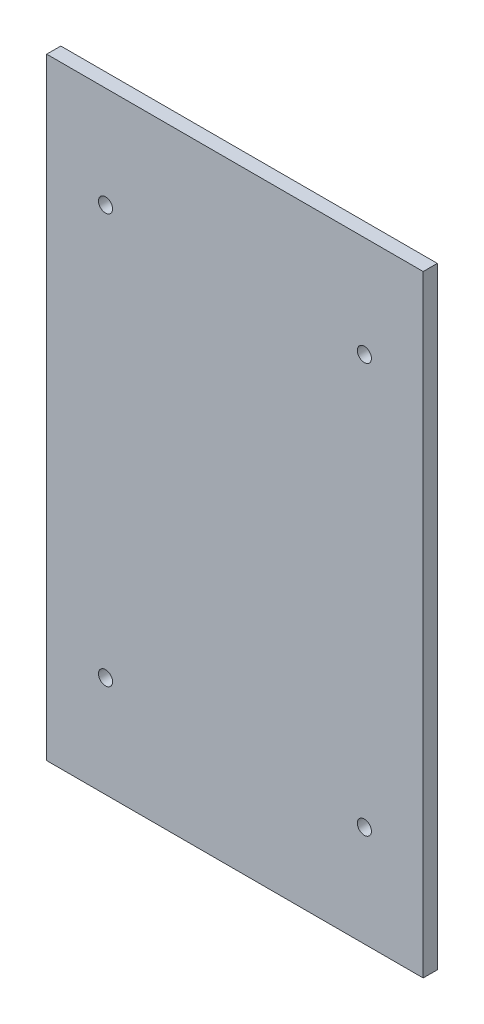
ISO-10303-21;
HEADER;
FILE_DESCRIPTION(('STEP AP214'),'2;1');
FILE_NAME('part.step','',(''),(''),'','','');
FILE_SCHEMA(('AUTOMOTIVE_DESIGN { 1 0 10303 214 1 1 1 1 }'));
ENDSEC;
DATA;
#1=APPLICATION_CONTEXT('core data for automotive mechanical design processes');
#2=APPLICATION_PROTOCOL_DEFINITION('international standard','automotive_design',2000,#1);
#3=PRODUCT_CONTEXT('',#1,'mechanical');
#4=PRODUCT('Part','Part','',(#3));
#5=PRODUCT_RELATED_PRODUCT_CATEGORY('part','',(#4));
#6=PRODUCT_DEFINITION_FORMATION('','',#4);
#7=PRODUCT_DEFINITION_CONTEXT('part definition',#1,'design');
#8=PRODUCT_DEFINITION('design','',#6,#7);
#9=PRODUCT_DEFINITION_SHAPE('','',#8);
#10=(LENGTH_UNIT() NAMED_UNIT(*) SI_UNIT(.MILLI.,.METRE.));
#11=(NAMED_UNIT(*) PLANE_ANGLE_UNIT() SI_UNIT($,.RADIAN.));
#12=(NAMED_UNIT(*) SI_UNIT($,.STERADIAN.) SOLID_ANGLE_UNIT());
#13=UNCERTAINTY_MEASURE_WITH_UNIT(LENGTH_MEASURE(1.E-05),#10,'distance_accuracy_value','');
#14=(GEOMETRIC_REPRESENTATION_CONTEXT(3) GLOBAL_UNCERTAINTY_ASSIGNED_CONTEXT((#13)) GLOBAL_UNIT_ASSIGNED_CONTEXT((#10,
#11,#12)) REPRESENTATION_CONTEXT('',''));
#15=CARTESIAN_POINT('',(0.,0.,0.));
#16=DIRECTION('',(0.,0.,1.));
#17=DIRECTION('',(1.,0.,0.));
#18=AXIS2_PLACEMENT_3D('',#15,#16,#17);
#19=CARTESIAN_POINT('',(-67.5,35.688006393794,3.));
#20=DIRECTION('',(0.,1.,0.));
#21=DIRECTION('',(0.,0.,1.));
#22=AXIS2_PLACEMENT_3D('',#19,#20,#21);
#23=PLANE('',#22);
#24=DIRECTION('',(1.,0.,0.));
#25=VECTOR('',#24,1.);
#26=CARTESIAN_POINT('',(-67.5,35.688006393794,0.));
#27=LINE('',#26,#25);
#28=CARTESIAN_POINT('',(-67.5,35.688006393794,0.));
#29=VERTEX_POINT('',#28);
#30=CARTESIAN_POINT('',(12.5,35.688006393794,0.));
#31=VERTEX_POINT('',#30);
#32=EDGE_CURVE('E110',#29,#31,#27,.T.);
#33=ORIENTED_EDGE('',*,*,#32,.F.);
#34=DIRECTION('',(0.,0.,-1.));
#35=VECTOR('',#34,1.);
#36=CARTESIAN_POINT('',(-67.5,35.688006393794,3.));
#37=LINE('',#36,#35);
#38=CARTESIAN_POINT('',(-67.5,35.688006393794,3.));
#39=VERTEX_POINT('',#38);
#40=EDGE_CURVE('E11',#39,#29,#37,.T.);
#41=ORIENTED_EDGE('',*,*,#40,.F.);
#42=DIRECTION('',(1.,0.,0.));
#43=VECTOR('',#42,1.);
#44=CARTESIAN_POINT('',(-67.5,35.688006393794,3.));
#45=LINE('',#44,#43);
#46=CARTESIAN_POINT('',(12.5,35.688006393794,3.));
#47=VERTEX_POINT('',#46);
#48=EDGE_CURVE('E102',#39,#47,#45,.T.);
#49=ORIENTED_EDGE('',*,*,#48,.T.);
#50=DIRECTION('',(0.,0.,-1.));
#51=VECTOR('',#50,1.);
#52=CARTESIAN_POINT('',(12.5,35.688006393794,3.));
#53=LINE('',#52,#51);
#54=EDGE_CURVE('E41',#47,#31,#53,.T.);
#55=ORIENTED_EDGE('',*,*,#54,.T.);
#56=EDGE_LOOP('',(#33,#41,#49,#55));
#57=FACE_BOUND('',#56,.T.);
#58=ADVANCED_FACE('F38',(#57),#23,.T.);
#59=CARTESIAN_POINT('',(-67.5,35.688006393794,3.));
#60=DIRECTION('',(1.,0.,0.));
#61=DIRECTION('',(0.,0.,-1.));
#62=AXIS2_PLACEMENT_3D('',#59,#60,#61);
#63=PLANE('',#62);
#64=DIRECTION('',(0.,-1.,0.));
#65=VECTOR('',#64,1.);
#66=CARTESIAN_POINT('',(-67.5,35.688006393794,0.));
#67=LINE('',#66,#65);
#68=CARTESIAN_POINT('',(-67.5,-94.311993606206,0.));
#69=VERTEX_POINT('',#68);
#70=EDGE_CURVE('E72',#29,#69,#67,.T.);
#71=ORIENTED_EDGE('',*,*,#70,.T.);
#72=DIRECTION('',(0.,0.,-1.));
#73=VECTOR('',#72,1.);
#74=CARTESIAN_POINT('',(-67.5,-94.311993606206,3.));
#75=LINE('',#74,#73);
#76=CARTESIAN_POINT('',(-67.5,-94.311993606206,3.));
#77=VERTEX_POINT('',#76);
#78=EDGE_CURVE('E48',#77,#69,#75,.T.);
#79=ORIENTED_EDGE('',*,*,#78,.F.);
#80=DIRECTION('',(0.,-1.,0.));
#81=VECTOR('',#80,1.);
#82=CARTESIAN_POINT('',(-67.5,35.688006393794,3.));
#83=LINE('',#82,#81);
#84=EDGE_CURVE('E89',#39,#77,#83,.T.);
#85=ORIENTED_EDGE('',*,*,#84,.F.);
#86=ORIENTED_EDGE('',*,*,#40,.T.);
#87=EDGE_LOOP('',(#71,#79,#85,#86));
#88=FACE_BOUND('',#87,.T.);
#89=ADVANCED_FACE('F127',(#88),#63,.F.);
#90=CARTESIAN_POINT('',(-67.5,-94.311993606206,3.));
#91=DIRECTION('',(0.,1.,0.));
#92=DIRECTION('',(0.,0.,1.));
#93=AXIS2_PLACEMENT_3D('',#90,#91,#92);
#94=PLANE('',#93);
#95=DIRECTION('',(1.,0.,0.));
#96=VECTOR('',#95,1.);
#97=CARTESIAN_POINT('',(-67.5,-94.311993606206,0.));
#98=LINE('',#97,#96);
#99=CARTESIAN_POINT('',(12.5,-94.311993606206,0.));
#100=VERTEX_POINT('',#99);
#101=EDGE_CURVE('E97',#69,#100,#98,.T.);
#102=ORIENTED_EDGE('',*,*,#101,.T.);
#103=DIRECTION('',(0.,0.,-1.));
#104=VECTOR('',#103,1.);
#105=CARTESIAN_POINT('',(12.5,-94.311993606206,3.));
#106=LINE('',#105,#104);
#107=CARTESIAN_POINT('',(12.5,-94.311993606206,3.));
#108=VERTEX_POINT('',#107);
#109=EDGE_CURVE('E94',#108,#100,#106,.T.);
#110=ORIENTED_EDGE('',*,*,#109,.F.);
#111=DIRECTION('',(1.,0.,0.));
#112=VECTOR('',#111,1.);
#113=CARTESIAN_POINT('',(-67.5,-94.311993606206,3.));
#114=LINE('',#113,#112);
#115=EDGE_CURVE('E84',#77,#108,#114,.T.);
#116=ORIENTED_EDGE('',*,*,#115,.F.);
#117=ORIENTED_EDGE('',*,*,#78,.T.);
#118=EDGE_LOOP('',(#102,#110,#116,#117));
#119=FACE_BOUND('',#118,.T.);
#120=ADVANCED_FACE('F95',(#119),#94,.F.);
#121=CARTESIAN_POINT('',(12.5,35.688006393794,3.));
#122=DIRECTION('',(1.,0.,0.));
#123=DIRECTION('',(0.,1.,0.));
#124=AXIS2_PLACEMENT_3D('',#121,#122,#123);
#125=PLANE('',#124);
#126=DIRECTION('',(0.,-1.,0.));
#127=VECTOR('',#126,1.);
#128=CARTESIAN_POINT('',(12.5,35.688006393794,0.));
#129=LINE('',#128,#127);
#130=EDGE_CURVE('E114',#31,#100,#129,.T.);
#131=ORIENTED_EDGE('',*,*,#130,.F.);
#132=ORIENTED_EDGE('',*,*,#54,.F.);
#133=DIRECTION('',(0.,-1.,0.));
#134=VECTOR('',#133,1.);
#135=CARTESIAN_POINT('',(12.5,35.688006393794,3.));
#136=LINE('',#135,#134);
#137=EDGE_CURVE('E88',#47,#108,#136,.T.);
#138=ORIENTED_EDGE('',*,*,#137,.T.);
#139=ORIENTED_EDGE('',*,*,#109,.T.);
#140=EDGE_LOOP('',(#131,#132,#138,#139));
#141=FACE_BOUND('',#140,.T.);
#142=ADVANCED_FACE('F100',(#141),#125,.T.);
#143=CARTESIAN_POINT('',(0.,0.,3.));
#144=DIRECTION('',(0.,0.,-1.));
#145=DIRECTION('',(-1.,0.,0.));
#146=AXIS2_PLACEMENT_3D('',#143,#144,#145);
#147=PLANE('',#146);
#148=CARTESIAN_POINT('',(-55.,-72.811993606206,3.));
#149=DIRECTION('',(0.,0.,1.));
#150=DIRECTION('',(1.,0.,0.));
#151=AXIS2_PLACEMENT_3D('',#148,#149,#150);
#152=CIRCLE('',#151,1.5);
#153=CARTESIAN_POINT('',(-53.5,-72.811993606206,3.));
#154=VERTEX_POINT('',#153);
#155=EDGE_CURVE('E172',#154,#154,#152,.T.);
#156=ORIENTED_EDGE('',*,*,#155,.F.);
#157=EDGE_LOOP('',(#156));
#158=FACE_BOUND('',#157,.T.);
#159=CARTESIAN_POINT('',(0.,-72.811993606206,3.));
#160=DIRECTION('',(0.,0.,1.));
#161=DIRECTION('',(1.,0.,0.));
#162=AXIS2_PLACEMENT_3D('',#159,#160,#161);
#163=CIRCLE('',#162,1.5);
#164=CARTESIAN_POINT('',(1.5,-72.811993606206,3.));
#165=VERTEX_POINT('',#164);
#166=EDGE_CURVE('E174',#165,#165,#163,.T.);
#167=ORIENTED_EDGE('',*,*,#166,.F.);
#168=EDGE_LOOP('',(#167));
#169=FACE_BOUND('',#168,.T.);
#170=CARTESIAN_POINT('',(0.,14.188006393794,3.));
#171=DIRECTION('',(0.,0.,1.));
#172=DIRECTION('',(1.,0.,0.));
#173=AXIS2_PLACEMENT_3D('',#170,#171,#172);
#174=CIRCLE('',#173,1.5);
#175=CARTESIAN_POINT('',(1.5,14.188006393794,3.));
#176=VERTEX_POINT('',#175);
#177=EDGE_CURVE('E178',#176,#176,#174,.T.);
#178=ORIENTED_EDGE('',*,*,#177,.F.);
#179=EDGE_LOOP('',(#178));
#180=FACE_BOUND('',#179,.T.);
#181=CARTESIAN_POINT('',(-55.,14.188006393794,3.));
#182=DIRECTION('',(0.,0.,1.));
#183=DIRECTION('',(1.,0.,0.));
#184=AXIS2_PLACEMENT_3D('',#181,#182,#183);
#185=CIRCLE('',#184,1.5);
#186=CARTESIAN_POINT('',(-53.5,14.188006393794,3.));
#187=VERTEX_POINT('',#186);
#188=EDGE_CURVE('E191',#187,#187,#185,.T.);
#189=ORIENTED_EDGE('',*,*,#188,.F.);
#190=EDGE_LOOP('',(#189));
#191=FACE_BOUND('',#190,.T.);
#192=ORIENTED_EDGE('',*,*,#48,.F.);
#193=ORIENTED_EDGE('',*,*,#84,.T.);
#194=ORIENTED_EDGE('',*,*,#115,.T.);
#195=ORIENTED_EDGE('',*,*,#137,.F.);
#196=EDGE_LOOP('',(#192,#193,#194,#195));
#197=FACE_BOUND('',#196,.T.);
#198=ADVANCED_FACE('F87',(#158,#169,#180,#191,#197),#147,.F.);
#199=CARTESIAN_POINT('',(0.,0.,0.));
#200=DIRECTION('',(0.,0.,-1.));
#201=DIRECTION('',(-1.,0.,0.));
#202=AXIS2_PLACEMENT_3D('',#199,#200,#201);
#203=PLANE('',#202);
#204=CARTESIAN_POINT('',(-55.,-72.811993606206,0.));
#205=DIRECTION('',(0.,0.,1.));
#206=DIRECTION('',(1.,0.,0.));
#207=AXIS2_PLACEMENT_3D('',#204,#205,#206);
#208=CIRCLE('',#207,1.5);
#209=CARTESIAN_POINT('',(-53.5,-72.811993606206,0.));
#210=VERTEX_POINT('',#209);
#211=EDGE_CURVE('E170',#210,#210,#208,.T.);
#212=ORIENTED_EDGE('',*,*,#211,.T.);
#213=EDGE_LOOP('',(#212));
#214=FACE_BOUND('',#213,.T.);
#215=CARTESIAN_POINT('',(0.,-72.811993606206,0.));
#216=DIRECTION('',(0.,0.,1.));
#217=DIRECTION('',(1.,0.,0.));
#218=AXIS2_PLACEMENT_3D('',#215,#216,#217);
#219=CIRCLE('',#218,1.5);
#220=CARTESIAN_POINT('',(1.5,-72.811993606206,0.));
#221=VERTEX_POINT('',#220);
#222=EDGE_CURVE('E181',#221,#221,#219,.T.);
#223=ORIENTED_EDGE('',*,*,#222,.T.);
#224=EDGE_LOOP('',(#223));
#225=FACE_BOUND('',#224,.T.);
#226=CARTESIAN_POINT('',(0.,14.188006393794,0.));
#227=DIRECTION('',(0.,0.,1.));
#228=DIRECTION('',(1.,0.,0.));
#229=AXIS2_PLACEMENT_3D('',#226,#227,#228);
#230=CIRCLE('',#229,1.5);
#231=CARTESIAN_POINT('',(1.5,14.188006393794,0.));
#232=VERTEX_POINT('',#231);
#233=EDGE_CURVE('E187',#232,#232,#230,.T.);
#234=ORIENTED_EDGE('',*,*,#233,.T.);
#235=EDGE_LOOP('',(#234));
#236=FACE_BOUND('',#235,.T.);
#237=CARTESIAN_POINT('',(-55.,14.188006393794,0.));
#238=DIRECTION('',(0.,0.,1.));
#239=DIRECTION('',(1.,0.,0.));
#240=AXIS2_PLACEMENT_3D('',#237,#238,#239);
#241=CIRCLE('',#240,1.5);
#242=CARTESIAN_POINT('',(-53.5,14.188006393794,0.));
#243=VERTEX_POINT('',#242);
#244=EDGE_CURVE('E115',#243,#243,#241,.T.);
#245=ORIENTED_EDGE('',*,*,#244,.T.);
#246=EDGE_LOOP('',(#245));
#247=FACE_BOUND('',#246,.T.);
#248=ORIENTED_EDGE('',*,*,#32,.T.);
#249=ORIENTED_EDGE('',*,*,#130,.T.);
#250=ORIENTED_EDGE('',*,*,#101,.F.);
#251=ORIENTED_EDGE('',*,*,#70,.F.);
#252=EDGE_LOOP('',(#248,#249,#250,#251));
#253=FACE_BOUND('',#252,.T.);
#254=ADVANCED_FACE('F124',(#214,#225,#236,#247,#253),#203,.T.);
#255=CARTESIAN_POINT('',(-55.,14.188006393794,0.));
#256=DIRECTION('',(0.,0.,1.));
#257=DIRECTION('',(1.,0.,0.));
#258=AXIS2_PLACEMENT_3D('',#255,#256,#257);
#259=CYLINDRICAL_SURFACE('',#258,1.5);
#260=ORIENTED_EDGE('',*,*,#244,.F.);
#261=EDGE_LOOP('',(#260));
#262=FACE_BOUND('',#261,.T.);
#263=ORIENTED_EDGE('',*,*,#188,.T.);
#264=EDGE_LOOP('',(#263));
#265=FACE_BOUND('',#264,.T.);
#266=ADVANCED_FACE('F146',(#262,#265),#259,.F.);
#267=CARTESIAN_POINT('',(0.,14.188006393794,0.));
#268=DIRECTION('',(0.,0.,1.));
#269=DIRECTION('',(1.,0.,0.));
#270=AXIS2_PLACEMENT_3D('',#267,#268,#269);
#271=CYLINDRICAL_SURFACE('',#270,1.5);
#272=ORIENTED_EDGE('',*,*,#233,.F.);
#273=EDGE_LOOP('',(#272));
#274=FACE_BOUND('',#273,.T.);
#275=ORIENTED_EDGE('',*,*,#177,.T.);
#276=EDGE_LOOP('',(#275));
#277=FACE_BOUND('',#276,.T.);
#278=ADVANCED_FACE('F153',(#274,#277),#271,.F.);
#279=CARTESIAN_POINT('',(0.,-72.811993606206,0.));
#280=DIRECTION('',(0.,0.,1.));
#281=DIRECTION('',(1.,0.,0.));
#282=AXIS2_PLACEMENT_3D('',#279,#280,#281);
#283=CYLINDRICAL_SURFACE('',#282,1.5);
#284=ORIENTED_EDGE('',*,*,#222,.F.);
#285=EDGE_LOOP('',(#284));
#286=FACE_BOUND('',#285,.T.);
#287=ORIENTED_EDGE('',*,*,#166,.T.);
#288=EDGE_LOOP('',(#287));
#289=FACE_BOUND('',#288,.T.);
#290=ADVANCED_FACE('F157',(#286,#289),#283,.F.);
#291=CARTESIAN_POINT('',(-55.,-72.811993606206,0.));
#292=DIRECTION('',(0.,0.,1.));
#293=DIRECTION('',(1.,0.,0.));
#294=AXIS2_PLACEMENT_3D('',#291,#292,#293);
#295=CYLINDRICAL_SURFACE('',#294,1.5);
#296=ORIENTED_EDGE('',*,*,#211,.F.);
#297=EDGE_LOOP('',(#296));
#298=FACE_BOUND('',#297,.T.);
#299=ORIENTED_EDGE('',*,*,#155,.T.);
#300=EDGE_LOOP('',(#299));
#301=FACE_BOUND('',#300,.T.);
#302=ADVANCED_FACE('F161',(#298,#301),#295,.F.);
#303=CLOSED_SHELL('',(#58,#89,#120,#142,#198,#254,#266,#278,#290,#302));
#304=MANIFOLD_SOLID_BREP('B2',#303);
#305=ADVANCED_BREP_SHAPE_REPRESENTATION('',(#18,#304),#14);
#306=SHAPE_DEFINITION_REPRESENTATION(#9,#305);
ENDSEC;
END-ISO-10303-21;
